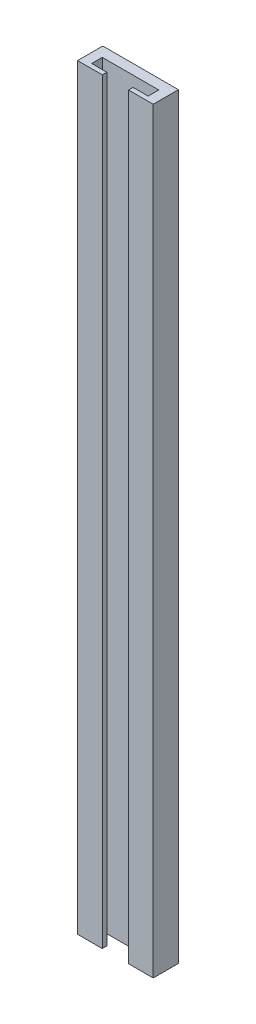
ISO-10303-21;
HEADER;
FILE_DESCRIPTION(('STEP AP214'),'2;1');
FILE_NAME('part.step','',(''),(''),'','','');
FILE_SCHEMA(('AUTOMOTIVE_DESIGN { 1 0 10303 214 1 1 1 1 }'));
ENDSEC;
DATA;
#1=APPLICATION_CONTEXT('core data for automotive mechanical design processes');
#2=APPLICATION_PROTOCOL_DEFINITION('international standard','automotive_design',2000,#1);
#3=PRODUCT_CONTEXT('',#1,'mechanical');
#4=PRODUCT('Part','Part','',(#3));
#5=PRODUCT_RELATED_PRODUCT_CATEGORY('part','',(#4));
#6=PRODUCT_DEFINITION_FORMATION('','',#4);
#7=PRODUCT_DEFINITION_CONTEXT('part definition',#1,'design');
#8=PRODUCT_DEFINITION('design','',#6,#7);
#9=PRODUCT_DEFINITION_SHAPE('','',#8);
#10=(LENGTH_UNIT() NAMED_UNIT(*) SI_UNIT(.MILLI.,.METRE.));
#11=(NAMED_UNIT(*) PLANE_ANGLE_UNIT() SI_UNIT($,.RADIAN.));
#12=(NAMED_UNIT(*) SI_UNIT($,.STERADIAN.) SOLID_ANGLE_UNIT());
#13=UNCERTAINTY_MEASURE_WITH_UNIT(LENGTH_MEASURE(1.E-05),#10,'distance_accuracy_value','');
#14=(GEOMETRIC_REPRESENTATION_CONTEXT(3) GLOBAL_UNCERTAINTY_ASSIGNED_CONTEXT((#13)) GLOBAL_UNIT_ASSIGNED_CONTEXT((#10,
#11,#12)) REPRESENTATION_CONTEXT('',''));
#15=CARTESIAN_POINT('',(0.,0.,0.));
#16=DIRECTION('',(0.,0.,1.));
#17=DIRECTION('',(1.,0.,0.));
#18=AXIS2_PLACEMENT_3D('',#15,#16,#17);
#19=CARTESIAN_POINT('',(4.3745606689616,150.,6.92142297910839));
#20=DIRECTION('',(-1.,0.,0.));
#21=DIRECTION('',(0.,0.,1.));
#22=AXIS2_PLACEMENT_3D('',#19,#20,#21);
#23=PLANE('',#22);
#24=DIRECTION('',(0.,0.,-1.));
#25=VECTOR('',#24,1.);
#26=CARTESIAN_POINT('',(4.3745606689616,0.,6.92142297910839));
#27=LINE('',#26,#25);
#28=CARTESIAN_POINT('',(4.3745606689616,0.,6.92142297910839));
#29=VERTEX_POINT('',#28);
#30=CARTESIAN_POINT('',(4.3745606689616,0.,1.92142297910839));
#31=VERTEX_POINT('',#30);
#32=EDGE_CURVE('E145',#29,#31,#27,.T.);
#33=ORIENTED_EDGE('',*,*,#32,.F.);
#34=DIRECTION('',(0.,-1.,0.));
#35=VECTOR('',#34,1.);
#36=CARTESIAN_POINT('',(4.3745606689616,150.,6.92142297910839));
#37=LINE('',#36,#35);
#38=CARTESIAN_POINT('',(4.3745606689616,150.,6.92142297910839));
#39=VERTEX_POINT('',#38);
#40=EDGE_CURVE('E32',#39,#29,#37,.T.);
#41=ORIENTED_EDGE('',*,*,#40,.F.);
#42=DIRECTION('',(0.,0.,-1.));
#43=VECTOR('',#42,1.);
#44=CARTESIAN_POINT('',(4.3745606689616,150.,6.92142297910839));
#45=LINE('',#44,#43);
#46=CARTESIAN_POINT('',(4.3745606689616,150.,1.92142297910839));
#47=VERTEX_POINT('',#46);
#48=EDGE_CURVE('E136',#39,#47,#45,.T.);
#49=ORIENTED_EDGE('',*,*,#48,.T.);
#50=DIRECTION('',(0.,-1.,0.));
#51=VECTOR('',#50,1.);
#52=CARTESIAN_POINT('',(4.3745606689616,150.,1.92142297910839));
#53=LINE('',#52,#51);
#54=EDGE_CURVE('E11',#47,#31,#53,.T.);
#55=ORIENTED_EDGE('',*,*,#54,.T.);
#56=EDGE_LOOP('',(#33,#41,#49,#55));
#57=FACE_BOUND('',#56,.T.);
#58=ADVANCED_FACE('F16',(#57),#23,.T.);
#59=CARTESIAN_POINT('',(4.3745606689616,150.,1.92142297910839));
#60=DIRECTION('',(0.,0.,-1.));
#61=DIRECTION('',(-1.,0.,0.));
#62=AXIS2_PLACEMENT_3D('',#59,#60,#61);
#63=PLANE('',#62);
#64=DIRECTION('',(1.,0.,0.));
#65=VECTOR('',#64,1.);
#66=CARTESIAN_POINT('',(4.3745606689616,0.,1.92142297910839));
#67=LINE('',#66,#65);
#68=CARTESIAN_POINT('',(19.3745606689616,0.,1.92142297910839));
#69=VERTEX_POINT('',#68);
#70=EDGE_CURVE('E140',#31,#69,#67,.T.);
#71=ORIENTED_EDGE('',*,*,#70,.F.);
#72=ORIENTED_EDGE('',*,*,#54,.F.);
#73=DIRECTION('',(1.,0.,0.));
#74=VECTOR('',#73,1.);
#75=CARTESIAN_POINT('',(4.3745606689616,150.,1.92142297910839));
#76=LINE('',#75,#74);
#77=CARTESIAN_POINT('',(19.3745606689616,150.,1.92142297910839));
#78=VERTEX_POINT('',#77);
#79=EDGE_CURVE('E138',#47,#78,#76,.T.);
#80=ORIENTED_EDGE('',*,*,#79,.T.);
#81=DIRECTION('',(0.,-1.,0.));
#82=VECTOR('',#81,1.);
#83=CARTESIAN_POINT('',(19.3745606689616,150.,1.92142297910839));
#84=LINE('',#83,#82);
#85=EDGE_CURVE('E24',#78,#69,#84,.T.);
#86=ORIENTED_EDGE('',*,*,#85,.T.);
#87=EDGE_LOOP('',(#71,#72,#80,#86));
#88=FACE_BOUND('',#87,.T.);
#89=ADVANCED_FACE('F198',(#88),#63,.T.);
#90=CARTESIAN_POINT('',(19.3745606689616,150.,1.92142297910839));
#91=DIRECTION('',(1.,0.,0.));
#92=DIRECTION('',(0.,0.,-1.));
#93=AXIS2_PLACEMENT_3D('',#90,#91,#92);
#94=PLANE('',#93);
#95=DIRECTION('',(0.,0.,1.));
#96=VECTOR('',#95,1.);
#97=CARTESIAN_POINT('',(19.3745606689616,0.,1.92142297910839));
#98=LINE('',#97,#96);
#99=CARTESIAN_POINT('',(19.3745606689616,0.,6.92142297910839));
#100=VERTEX_POINT('',#99);
#101=EDGE_CURVE('E144',#69,#100,#98,.T.);
#102=ORIENTED_EDGE('',*,*,#101,.F.);
#103=ORIENTED_EDGE('',*,*,#85,.F.);
#104=DIRECTION('',(0.,0.,1.));
#105=VECTOR('',#104,1.);
#106=CARTESIAN_POINT('',(19.3745606689616,150.,1.92142297910839));
#107=LINE('',#106,#105);
#108=CARTESIAN_POINT('',(19.3745606689616,150.,6.92142297910839));
#109=VERTEX_POINT('',#108);
#110=EDGE_CURVE('E207',#78,#109,#107,.T.);
#111=ORIENTED_EDGE('',*,*,#110,.T.);
#112=DIRECTION('',(0.,-1.,0.));
#113=VECTOR('',#112,1.);
#114=CARTESIAN_POINT('',(19.3745606689616,150.,6.92142297910839));
#115=LINE('',#114,#113);
#116=EDGE_CURVE('E196',#109,#100,#115,.T.);
#117=ORIENTED_EDGE('',*,*,#116,.T.);
#118=EDGE_LOOP('',(#102,#103,#111,#117));
#119=FACE_BOUND('',#118,.T.);
#120=ADVANCED_FACE('F202',(#119),#94,.T.);
#121=CARTESIAN_POINT('',(19.3745606689616,150.,6.92142297910839));
#122=DIRECTION('',(0.,0.,1.));
#123=DIRECTION('',(1.,0.,0.));
#124=AXIS2_PLACEMENT_3D('',#121,#122,#123);
#125=PLANE('',#124);
#126=DIRECTION('',(-1.,0.,0.));
#127=VECTOR('',#126,1.);
#128=CARTESIAN_POINT('',(19.3745606689616,0.,6.92142297910839));
#129=LINE('',#128,#127);
#130=CARTESIAN_POINT('',(14.4745606689616,0.,6.92142297910839));
#131=VERTEX_POINT('',#130);
#132=EDGE_CURVE('E149',#100,#131,#129,.T.);
#133=ORIENTED_EDGE('',*,*,#132,.F.);
#134=ORIENTED_EDGE('',*,*,#116,.F.);
#135=DIRECTION('',(-1.,0.,0.));
#136=VECTOR('',#135,1.);
#137=CARTESIAN_POINT('',(19.3745606689616,150.,6.92142297910839));
#138=LINE('',#137,#136);
#139=CARTESIAN_POINT('',(14.4745606689616,150.,6.92142297910839));
#140=VERTEX_POINT('',#139);
#141=EDGE_CURVE('E209',#109,#140,#138,.T.);
#142=ORIENTED_EDGE('',*,*,#141,.T.);
#143=DIRECTION('',(0.,-1.,0.));
#144=VECTOR('',#143,1.);
#145=CARTESIAN_POINT('',(14.4745606689616,150.,6.92142297910839));
#146=LINE('',#145,#144);
#147=EDGE_CURVE('E194',#140,#131,#146,.T.);
#148=ORIENTED_EDGE('',*,*,#147,.T.);
#149=EDGE_LOOP('',(#133,#134,#142,#148));
#150=FACE_BOUND('',#149,.T.);
#151=ADVANCED_FACE('F245',(#150),#125,.T.);
#152=CARTESIAN_POINT('',(14.4745606689616,150.,6.92142297910839));
#153=DIRECTION('',(-1.,0.,0.));
#154=DIRECTION('',(0.,0.,1.));
#155=AXIS2_PLACEMENT_3D('',#152,#153,#154);
#156=PLANE('',#155);
#157=DIRECTION('',(0.,0.,-1.));
#158=VECTOR('',#157,1.);
#159=CARTESIAN_POINT('',(14.4745606689616,0.,6.92142297910839));
#160=LINE('',#159,#158);
#161=CARTESIAN_POINT('',(14.4745606689616,0.,6.02142297910839));
#162=VERTEX_POINT('',#161);
#163=EDGE_CURVE('E153',#131,#162,#160,.T.);
#164=ORIENTED_EDGE('',*,*,#163,.F.);
#165=ORIENTED_EDGE('',*,*,#147,.F.);
#166=DIRECTION('',(0.,0.,-1.));
#167=VECTOR('',#166,1.);
#168=CARTESIAN_POINT('',(14.4745606689616,150.,6.92142297910839));
#169=LINE('',#168,#167);
#170=CARTESIAN_POINT('',(14.4745606689616,150.,6.02142297910839));
#171=VERTEX_POINT('',#170);
#172=EDGE_CURVE('E214',#140,#171,#169,.T.);
#173=ORIENTED_EDGE('',*,*,#172,.T.);
#174=DIRECTION('',(0.,-1.,0.));
#175=VECTOR('',#174,1.);
#176=CARTESIAN_POINT('',(14.4745606689616,150.,6.02142297910839));
#177=LINE('',#176,#175);
#178=EDGE_CURVE('E192',#171,#162,#177,.T.);
#179=ORIENTED_EDGE('',*,*,#178,.T.);
#180=EDGE_LOOP('',(#164,#165,#173,#179));
#181=FACE_BOUND('',#180,.T.);
#182=ADVANCED_FACE('F243',(#181),#156,.T.);
#183=CARTESIAN_POINT('',(14.4745606689616,150.,6.02142297910839));
#184=DIRECTION('',(0.,0.,-1.));
#185=DIRECTION('',(-1.,0.,0.));
#186=AXIS2_PLACEMENT_3D('',#183,#184,#185);
#187=PLANE('',#186);
#188=DIRECTION('',(1.,0.,0.));
#189=VECTOR('',#188,1.);
#190=CARTESIAN_POINT('',(14.4745606689616,0.,6.02142297910839));
#191=LINE('',#190,#189);
#192=CARTESIAN_POINT('',(17.4745606689616,0.,6.02142297910839));
#193=VERTEX_POINT('',#192);
#194=EDGE_CURVE('E157',#162,#193,#191,.T.);
#195=ORIENTED_EDGE('',*,*,#194,.F.);
#196=ORIENTED_EDGE('',*,*,#178,.F.);
#197=DIRECTION('',(1.,0.,0.));
#198=VECTOR('',#197,1.);
#199=CARTESIAN_POINT('',(14.4745606689616,150.,6.02142297910839));
#200=LINE('',#199,#198);
#201=CARTESIAN_POINT('',(17.4745606689616,150.,6.02142297910839));
#202=VERTEX_POINT('',#201);
#203=EDGE_CURVE('E217',#171,#202,#200,.T.);
#204=ORIENTED_EDGE('',*,*,#203,.T.);
#205=DIRECTION('',(0.,-1.,0.));
#206=VECTOR('',#205,1.);
#207=CARTESIAN_POINT('',(17.4745606689616,150.,6.02142297910839));
#208=LINE('',#207,#206);
#209=EDGE_CURVE('E190',#202,#193,#208,.T.);
#210=ORIENTED_EDGE('',*,*,#209,.T.);
#211=EDGE_LOOP('',(#195,#196,#204,#210));
#212=FACE_BOUND('',#211,.T.);
#213=ADVANCED_FACE('F239',(#212),#187,.T.);
#214=CARTESIAN_POINT('',(17.4745606689616,150.,6.02142297910839));
#215=DIRECTION('',(-1.,0.,0.));
#216=DIRECTION('',(0.,0.,1.));
#217=AXIS2_PLACEMENT_3D('',#214,#215,#216);
#218=PLANE('',#217);
#219=DIRECTION('',(0.,0.,-1.));
#220=VECTOR('',#219,1.);
#221=CARTESIAN_POINT('',(17.4745606689616,0.,6.02142297910839));
#222=LINE('',#221,#220);
#223=CARTESIAN_POINT('',(17.4745606689616,0.,3.92142297910839));
#224=VERTEX_POINT('',#223);
#225=EDGE_CURVE('E161',#193,#224,#222,.T.);
#226=ORIENTED_EDGE('',*,*,#225,.F.);
#227=ORIENTED_EDGE('',*,*,#209,.F.);
#228=DIRECTION('',(0.,0.,-1.));
#229=VECTOR('',#228,1.);
#230=CARTESIAN_POINT('',(17.4745606689616,150.,6.02142297910839));
#231=LINE('',#230,#229);
#232=CARTESIAN_POINT('',(17.4745606689616,150.,3.92142297910839));
#233=VERTEX_POINT('',#232);
#234=EDGE_CURVE('E220',#202,#233,#231,.T.);
#235=ORIENTED_EDGE('',*,*,#234,.T.);
#236=DIRECTION('',(0.,-1.,0.));
#237=VECTOR('',#236,1.);
#238=CARTESIAN_POINT('',(17.4745606689616,150.,3.92142297910839));
#239=LINE('',#238,#237);
#240=EDGE_CURVE('E188',#233,#224,#239,.T.);
#241=ORIENTED_EDGE('',*,*,#240,.T.);
#242=EDGE_LOOP('',(#226,#227,#235,#241));
#243=FACE_BOUND('',#242,.T.);
#244=ADVANCED_FACE('F236',(#243),#218,.T.);
#245=CARTESIAN_POINT('',(17.4745606689616,150.,3.92142297910839));
#246=DIRECTION('',(0.,0.,1.));
#247=DIRECTION('',(1.,0.,0.));
#248=AXIS2_PLACEMENT_3D('',#245,#246,#247);
#249=PLANE('',#248);
#250=DIRECTION('',(-1.,0.,0.));
#251=VECTOR('',#250,1.);
#252=CARTESIAN_POINT('',(17.4745606689616,0.,3.92142297910839));
#253=LINE('',#252,#251);
#254=CARTESIAN_POINT('',(6.2745606689616,0.,3.92142297910839));
#255=VERTEX_POINT('',#254);
#256=EDGE_CURVE('E165',#224,#255,#253,.T.);
#257=ORIENTED_EDGE('',*,*,#256,.F.);
#258=ORIENTED_EDGE('',*,*,#240,.F.);
#259=DIRECTION('',(-1.,0.,0.));
#260=VECTOR('',#259,1.);
#261=CARTESIAN_POINT('',(17.4745606689616,150.,3.92142297910839));
#262=LINE('',#261,#260);
#263=CARTESIAN_POINT('',(6.2745606689616,150.,3.92142297910839));
#264=VERTEX_POINT('',#263);
#265=EDGE_CURVE('E223',#233,#264,#262,.T.);
#266=ORIENTED_EDGE('',*,*,#265,.T.);
#267=DIRECTION('',(0.,-1.,0.));
#268=VECTOR('',#267,1.);
#269=CARTESIAN_POINT('',(6.2745606689616,150.,3.92142297910839));
#270=LINE('',#269,#268);
#271=EDGE_CURVE('E186',#264,#255,#270,.T.);
#272=ORIENTED_EDGE('',*,*,#271,.T.);
#273=EDGE_LOOP('',(#257,#258,#266,#272));
#274=FACE_BOUND('',#273,.T.);
#275=ADVANCED_FACE('F233',(#274),#249,.T.);
#276=CARTESIAN_POINT('',(6.2745606689616,150.,3.92142297910839));
#277=DIRECTION('',(1.,0.,0.));
#278=DIRECTION('',(0.,0.,-1.));
#279=AXIS2_PLACEMENT_3D('',#276,#277,#278);
#280=PLANE('',#279);
#281=DIRECTION('',(0.,0.,1.));
#282=VECTOR('',#281,1.);
#283=CARTESIAN_POINT('',(6.2745606689616,0.,3.92142297910839));
#284=LINE('',#283,#282);
#285=CARTESIAN_POINT('',(6.2745606689616,0.,6.02142297910839));
#286=VERTEX_POINT('',#285);
#287=EDGE_CURVE('E169',#255,#286,#284,.T.);
#288=ORIENTED_EDGE('',*,*,#287,.F.);
#289=ORIENTED_EDGE('',*,*,#271,.F.);
#290=DIRECTION('',(0.,0.,1.));
#291=VECTOR('',#290,1.);
#292=CARTESIAN_POINT('',(6.2745606689616,150.,3.92142297910839));
#293=LINE('',#292,#291);
#294=CARTESIAN_POINT('',(6.2745606689616,150.,6.02142297910839));
#295=VERTEX_POINT('',#294);
#296=EDGE_CURVE('E127',#264,#295,#293,.T.);
#297=ORIENTED_EDGE('',*,*,#296,.T.);
#298=DIRECTION('',(0.,-1.,0.));
#299=VECTOR('',#298,1.);
#300=CARTESIAN_POINT('',(6.2745606689616,150.,6.02142297910839));
#301=LINE('',#300,#299);
#302=EDGE_CURVE('E119',#295,#286,#301,.T.);
#303=ORIENTED_EDGE('',*,*,#302,.T.);
#304=EDGE_LOOP('',(#288,#289,#297,#303));
#305=FACE_BOUND('',#304,.T.);
#306=ADVANCED_FACE('F227',(#305),#280,.T.);
#307=CARTESIAN_POINT('',(6.2745606689616,150.,6.02142297910839));
#308=DIRECTION('',(0.,0.,-1.));
#309=DIRECTION('',(-1.,0.,0.));
#310=AXIS2_PLACEMENT_3D('',#307,#308,#309);
#311=PLANE('',#310);
#312=DIRECTION('',(1.,0.,0.));
#313=VECTOR('',#312,1.);
#314=CARTESIAN_POINT('',(6.2745606689616,0.,6.02142297910839));
#315=LINE('',#314,#313);
#316=CARTESIAN_POINT('',(9.2745606689616,0.,6.02142297910839));
#317=VERTEX_POINT('',#316);
#318=EDGE_CURVE('E173',#286,#317,#315,.T.);
#319=ORIENTED_EDGE('',*,*,#318,.F.);
#320=ORIENTED_EDGE('',*,*,#302,.F.);
#321=DIRECTION('',(1.,0.,0.));
#322=VECTOR('',#321,1.);
#323=CARTESIAN_POINT('',(6.2745606689616,150.,6.02142297910839));
#324=LINE('',#323,#322);
#325=CARTESIAN_POINT('',(9.2745606689616,150.,6.02142297910839));
#326=VERTEX_POINT('',#325);
#327=EDGE_CURVE('E122',#295,#326,#324,.T.);
#328=ORIENTED_EDGE('',*,*,#327,.T.);
#329=DIRECTION('',(0.,-1.,0.));
#330=VECTOR('',#329,1.);
#331=CARTESIAN_POINT('',(9.2745606689616,150.,6.02142297910839));
#332=LINE('',#331,#330);
#333=EDGE_CURVE('E108',#326,#317,#332,.T.);
#334=ORIENTED_EDGE('',*,*,#333,.T.);
#335=EDGE_LOOP('',(#319,#320,#328,#334));
#336=FACE_BOUND('',#335,.T.);
#337=ADVANCED_FACE('F123',(#336),#311,.T.);
#338=CARTESIAN_POINT('',(9.2745606689616,150.,6.02142297910839));
#339=DIRECTION('',(1.,0.,0.));
#340=DIRECTION('',(0.,0.,-1.));
#341=AXIS2_PLACEMENT_3D('',#338,#339,#340);
#342=PLANE('',#341);
#343=DIRECTION('',(0.,0.,1.));
#344=VECTOR('',#343,1.);
#345=CARTESIAN_POINT('',(9.2745606689616,0.,6.02142297910839));
#346=LINE('',#345,#344);
#347=CARTESIAN_POINT('',(9.2745606689616,0.,6.92142297910839));
#348=VERTEX_POINT('',#347);
#349=EDGE_CURVE('E115',#317,#348,#346,.T.);
#350=ORIENTED_EDGE('',*,*,#349,.F.);
#351=ORIENTED_EDGE('',*,*,#333,.F.);
#352=DIRECTION('',(0.,0.,1.));
#353=VECTOR('',#352,1.);
#354=CARTESIAN_POINT('',(9.2745606689616,150.,6.02142297910839));
#355=LINE('',#354,#353);
#356=CARTESIAN_POINT('',(9.2745606689616,150.,6.92142297910839));
#357=VERTEX_POINT('',#356);
#358=EDGE_CURVE('E112',#326,#357,#355,.T.);
#359=ORIENTED_EDGE('',*,*,#358,.T.);
#360=DIRECTION('',(0.,-1.,0.));
#361=VECTOR('',#360,1.);
#362=CARTESIAN_POINT('',(9.2745606689616,150.,6.92142297910839));
#363=LINE('',#362,#361);
#364=EDGE_CURVE('E72',#357,#348,#363,.T.);
#365=ORIENTED_EDGE('',*,*,#364,.T.);
#366=EDGE_LOOP('',(#350,#351,#359,#365));
#367=FACE_BOUND('',#366,.T.);
#368=ADVANCED_FACE('F110',(#367),#342,.T.);
#369=CARTESIAN_POINT('',(9.2745606689616,150.,6.92142297910839));
#370=DIRECTION('',(0.,0.,1.));
#371=DIRECTION('',(1.,0.,0.));
#372=AXIS2_PLACEMENT_3D('',#369,#370,#371);
#373=PLANE('',#372);
#374=DIRECTION('',(-1.,0.,0.));
#375=VECTOR('',#374,1.);
#376=CARTESIAN_POINT('',(9.2745606689616,0.,6.92142297910839));
#377=LINE('',#376,#375);
#378=EDGE_CURVE('E139',#348,#29,#377,.T.);
#379=ORIENTED_EDGE('',*,*,#378,.F.);
#380=ORIENTED_EDGE('',*,*,#364,.F.);
#381=DIRECTION('',(-1.,0.,0.));
#382=VECTOR('',#381,1.);
#383=CARTESIAN_POINT('',(9.2745606689616,150.,6.92142297910839));
#384=LINE('',#383,#382);
#385=EDGE_CURVE('E131',#357,#39,#384,.T.);
#386=ORIENTED_EDGE('',*,*,#385,.T.);
#387=ORIENTED_EDGE('',*,*,#40,.T.);
#388=EDGE_LOOP('',(#379,#380,#386,#387));
#389=FACE_BOUND('',#388,.T.);
#390=ADVANCED_FACE('F337',(#389),#373,.T.);
#391=CARTESIAN_POINT('',(0.,150.,0.));
#392=DIRECTION('',(0.,-1.,0.));
#393=DIRECTION('',(0.,0.,-1.));
#394=AXIS2_PLACEMENT_3D('',#391,#392,#393);
#395=PLANE('',#394);
#396=ORIENTED_EDGE('',*,*,#48,.F.);
#397=ORIENTED_EDGE('',*,*,#385,.F.);
#398=ORIENTED_EDGE('',*,*,#358,.F.);
#399=ORIENTED_EDGE('',*,*,#327,.F.);
#400=ORIENTED_EDGE('',*,*,#296,.F.);
#401=ORIENTED_EDGE('',*,*,#265,.F.);
#402=ORIENTED_EDGE('',*,*,#234,.F.);
#403=ORIENTED_EDGE('',*,*,#203,.F.);
#404=ORIENTED_EDGE('',*,*,#172,.F.);
#405=ORIENTED_EDGE('',*,*,#141,.F.);
#406=ORIENTED_EDGE('',*,*,#110,.F.);
#407=ORIENTED_EDGE('',*,*,#79,.F.);
#408=EDGE_LOOP('',(#396,#397,#398,#399,#400,#401,#402,#403,#404,#405,#406,#407));
#409=FACE_BOUND('',#408,.T.);
#410=ADVANCED_FACE('F130',(#409),#395,.F.);
#411=CARTESIAN_POINT('',(0.,0.,0.));
#412=DIRECTION('',(0.,-1.,0.));
#413=DIRECTION('',(0.,0.,-1.));
#414=AXIS2_PLACEMENT_3D('',#411,#412,#413);
#415=PLANE('',#414);
#416=ORIENTED_EDGE('',*,*,#32,.T.);
#417=ORIENTED_EDGE('',*,*,#70,.T.);
#418=ORIENTED_EDGE('',*,*,#101,.T.);
#419=ORIENTED_EDGE('',*,*,#132,.T.);
#420=ORIENTED_EDGE('',*,*,#163,.T.);
#421=ORIENTED_EDGE('',*,*,#194,.T.);
#422=ORIENTED_EDGE('',*,*,#225,.T.);
#423=ORIENTED_EDGE('',*,*,#256,.T.);
#424=ORIENTED_EDGE('',*,*,#287,.T.);
#425=ORIENTED_EDGE('',*,*,#318,.T.);
#426=ORIENTED_EDGE('',*,*,#349,.T.);
#427=ORIENTED_EDGE('',*,*,#378,.T.);
#428=EDGE_LOOP('',(#416,#417,#418,#419,#420,#421,#422,#423,#424,#425,#426,#427));
#429=FACE_BOUND('',#428,.T.);
#430=ADVANCED_FACE('F205',(#429),#415,.T.);
#431=CLOSED_SHELL('',(#58,#89,#120,#151,#182,#213,#244,#275,#306,#337,#368,#390,#410,#430));
#432=MANIFOLD_SOLID_BREP('B1',#431);
#433=ADVANCED_BREP_SHAPE_REPRESENTATION('',(#18,#432),#14);
#434=SHAPE_DEFINITION_REPRESENTATION(#9,#433);
ENDSEC;
END-ISO-10303-21;
